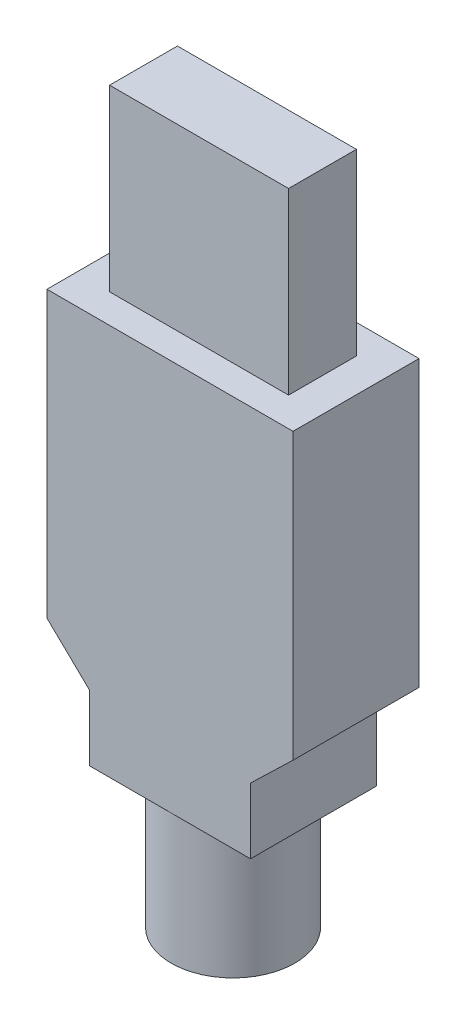
ISO-10303-21;
HEADER;
FILE_DESCRIPTION(('STEP AP214'),'2;1');
FILE_NAME('part.step','',(''),(''),'','','');
FILE_SCHEMA(('AUTOMOTIVE_DESIGN { 1 0 10303 214 1 1 1 1 }'));
ENDSEC;
DATA;
#1=APPLICATION_CONTEXT('core data for automotive mechanical design processes');
#2=APPLICATION_PROTOCOL_DEFINITION('international standard','automotive_design',2000,#1);
#3=PRODUCT_CONTEXT('',#1,'mechanical');
#4=PRODUCT('Part','Part','',(#3));
#5=PRODUCT_RELATED_PRODUCT_CATEGORY('part','',(#4));
#6=PRODUCT_DEFINITION_FORMATION('','',#4);
#7=PRODUCT_DEFINITION_CONTEXT('part definition',#1,'design');
#8=PRODUCT_DEFINITION('design','',#6,#7);
#9=PRODUCT_DEFINITION_SHAPE('','',#8);
#10=(LENGTH_UNIT() NAMED_UNIT(*) SI_UNIT(.MILLI.,.METRE.));
#11=(NAMED_UNIT(*) PLANE_ANGLE_UNIT() SI_UNIT($,.RADIAN.));
#12=(NAMED_UNIT(*) SI_UNIT($,.STERADIAN.) SOLID_ANGLE_UNIT());
#13=UNCERTAINTY_MEASURE_WITH_UNIT(LENGTH_MEASURE(1.E-05),#10,'distance_accuracy_value','');
#14=(GEOMETRIC_REPRESENTATION_CONTEXT(3) GLOBAL_UNCERTAINTY_ASSIGNED_CONTEXT((#13)) GLOBAL_UNIT_ASSIGNED_CONTEXT((#10,
#11,#12)) REPRESENTATION_CONTEXT('',''));
#15=CARTESIAN_POINT('',(0.,0.,0.));
#16=DIRECTION('',(0.,0.,1.));
#17=DIRECTION('',(1.,0.,0.));
#18=AXIS2_PLACEMENT_3D('',#15,#16,#17);
#19=CARTESIAN_POINT('',(0.,0.,-2.275));
#20=DIRECTION('',(0.,0.,-1.));
#21=DIRECTION('',(0.,-1.,0.));
#22=AXIS2_PLACEMENT_3D('',#19,#20,#21);
#23=PLANE('',#22);
#24=DIRECTION('',(1.,0.,0.));
#25=VECTOR('',#24,1.);
#26=CARTESIAN_POINT('',(6.,147.025,-2.275));
#27=LINE('',#26,#25);
#28=CARTESIAN_POINT('',(-6.,147.025,-2.275));
#29=VERTEX_POINT('',#28);
#30=CARTESIAN_POINT('',(6.,147.025,-2.275));
#31=VERTEX_POINT('',#30);
#32=EDGE_CURVE('P0_E72',#29,#31,#27,.T.);
#33=ORIENTED_EDGE('',*,*,#32,.F.);
#34=DIRECTION('',(0.,-1.,0.));
#35=VECTOR('',#34,1.);
#36=CARTESIAN_POINT('',(-6.,147.025,-2.275));
#37=LINE('',#36,#35);
#38=CARTESIAN_POINT('',(-6.,159.025,-2.275));
#39=VERTEX_POINT('',#38);
#40=EDGE_CURVE('P0_E27',#39,#29,#37,.T.);
#41=ORIENTED_EDGE('',*,*,#40,.F.);
#42=DIRECTION('',(-1.,0.,0.));
#43=VECTOR('',#42,1.);
#44=CARTESIAN_POINT('',(-6.,159.025,-2.275));
#45=LINE('',#44,#43);
#46=CARTESIAN_POINT('',(6.,159.025,-2.275));
#47=VERTEX_POINT('',#46);
#48=EDGE_CURVE('P0_E20',#47,#39,#45,.T.);
#49=ORIENTED_EDGE('',*,*,#48,.F.);
#50=DIRECTION('',(0.,1.,0.));
#51=VECTOR('',#50,1.);
#52=CARTESIAN_POINT('',(6.,159.025,-2.275));
#53=LINE('',#52,#51);
#54=EDGE_CURVE('P0_E69',#31,#47,#53,.T.);
#55=ORIENTED_EDGE('',*,*,#54,.F.);
#56=EDGE_LOOP('',(#33,#41,#49,#55));
#57=FACE_BOUND('',#56,.T.);
#58=ADVANCED_FACE('P0_F16',(#57),#23,.T.);
#59=CARTESIAN_POINT('',(0.,0.,2.275));
#60=DIRECTION('',(0.,0.,-1.));
#61=DIRECTION('',(0.,-1.,0.));
#62=AXIS2_PLACEMENT_3D('',#59,#60,#61);
#63=PLANE('',#62);
#64=DIRECTION('',(1.,0.,0.));
#65=VECTOR('',#64,1.);
#66=CARTESIAN_POINT('',(6.,147.025,2.275));
#67=LINE('',#66,#65);
#68=CARTESIAN_POINT('',(-6.,147.025,2.275));
#69=VERTEX_POINT('',#68);
#70=CARTESIAN_POINT('',(6.,147.025,2.275));
#71=VERTEX_POINT('',#70);
#72=EDGE_CURVE('P0_E90',#69,#71,#67,.T.);
#73=ORIENTED_EDGE('',*,*,#72,.T.);
#74=DIRECTION('',(0.,1.,0.));
#75=VECTOR('',#74,1.);
#76=CARTESIAN_POINT('',(6.,159.025,2.275));
#77=LINE('',#76,#75);
#78=CARTESIAN_POINT('',(6.,159.025,2.275));
#79=VERTEX_POINT('',#78);
#80=EDGE_CURVE('P0_E85',#71,#79,#77,.T.);
#81=ORIENTED_EDGE('',*,*,#80,.T.);
#82=DIRECTION('',(-1.,0.,0.));
#83=VECTOR('',#82,1.);
#84=CARTESIAN_POINT('',(-6.,159.025,2.275));
#85=LINE('',#84,#83);
#86=CARTESIAN_POINT('',(-6.,159.025,2.275));
#87=VERTEX_POINT('',#86);
#88=EDGE_CURVE('P0_E100',#79,#87,#85,.T.);
#89=ORIENTED_EDGE('',*,*,#88,.T.);
#90=DIRECTION('',(0.,-1.,0.));
#91=VECTOR('',#90,1.);
#92=CARTESIAN_POINT('',(-6.,147.025,2.275));
#93=LINE('',#92,#91);
#94=EDGE_CURVE('P0_E11',#87,#69,#93,.T.);
#95=ORIENTED_EDGE('',*,*,#94,.T.);
#96=EDGE_LOOP('',(#73,#81,#89,#95));
#97=FACE_BOUND('',#96,.T.);
#98=ADVANCED_FACE('P0_F197',(#97),#63,.F.);
#99=CARTESIAN_POINT('',(-6.,147.025,2.275));
#100=DIRECTION('',(1.,0.,0.));
#101=DIRECTION('',(0.,1.,0.));
#102=AXIS2_PLACEMENT_3D('',#99,#100,#101);
#103=PLANE('',#102);
#104=ORIENTED_EDGE('',*,*,#40,.T.);
#105=DIRECTION('',(0.,0.,-1.));
#106=VECTOR('',#105,1.);
#107=CARTESIAN_POINT('',(-6.,147.025,2.275));
#108=LINE('',#107,#106);
#109=EDGE_CURVE('P0_E79',#69,#29,#108,.T.);
#110=ORIENTED_EDGE('',*,*,#109,.F.);
#111=ORIENTED_EDGE('',*,*,#94,.F.);
#112=DIRECTION('',(0.,0.,-1.));
#113=VECTOR('',#112,1.);
#114=CARTESIAN_POINT('',(-6.,159.025,2.275));
#115=LINE('',#114,#113);
#116=EDGE_CURVE('P0_E101',#87,#39,#115,.T.);
#117=ORIENTED_EDGE('',*,*,#116,.T.);
#118=EDGE_LOOP('',(#104,#110,#111,#117));
#119=FACE_BOUND('',#118,.T.);
#120=ADVANCED_FACE('P0_F190',(#119),#103,.F.);
#121=CARTESIAN_POINT('',(-6.,159.025,2.275));
#122=DIRECTION('',(0.,-1.,0.));
#123=DIRECTION('',(0.,0.,-1.));
#124=AXIS2_PLACEMENT_3D('',#121,#122,#123);
#125=PLANE('',#124);
#126=ORIENTED_EDGE('',*,*,#48,.T.);
#127=ORIENTED_EDGE('',*,*,#116,.F.);
#128=ORIENTED_EDGE('',*,*,#88,.F.);
#129=DIRECTION('',(0.,0.,-1.));
#130=VECTOR('',#129,1.);
#131=CARTESIAN_POINT('',(6.,159.025,2.275));
#132=LINE('',#131,#130);
#133=EDGE_CURVE('P0_E78',#79,#47,#132,.T.);
#134=ORIENTED_EDGE('',*,*,#133,.T.);
#135=EDGE_LOOP('',(#126,#127,#128,#134));
#136=FACE_BOUND('',#135,.T.);
#137=ADVANCED_FACE('P0_F116',(#136),#125,.F.);
#138=CARTESIAN_POINT('',(6.,159.025,2.275));
#139=DIRECTION('',(-1.,0.,0.));
#140=DIRECTION('',(0.,0.,1.));
#141=AXIS2_PLACEMENT_3D('',#138,#139,#140);
#142=PLANE('',#141);
#143=ORIENTED_EDGE('',*,*,#54,.T.);
#144=ORIENTED_EDGE('',*,*,#133,.F.);
#145=ORIENTED_EDGE('',*,*,#80,.F.);
#146=DIRECTION('',(0.,0.,-1.));
#147=VECTOR('',#146,1.);
#148=CARTESIAN_POINT('',(6.,147.025,2.275));
#149=LINE('',#148,#147);
#150=EDGE_CURVE('P0_E82',#71,#31,#149,.T.);
#151=ORIENTED_EDGE('',*,*,#150,.T.);
#152=EDGE_LOOP('',(#143,#144,#145,#151));
#153=FACE_BOUND('',#152,.T.);
#154=ADVANCED_FACE('P0_F83',(#153),#142,.F.);
#155=CARTESIAN_POINT('',(6.,147.025,2.275));
#156=DIRECTION('',(0.,1.,0.));
#157=DIRECTION('',(1.,0.,0.));
#158=AXIS2_PLACEMENT_3D('',#155,#156,#157);
#159=PLANE('',#158);
#160=ORIENTED_EDGE('',*,*,#32,.T.);
#161=ORIENTED_EDGE('',*,*,#150,.F.);
#162=ORIENTED_EDGE('',*,*,#72,.F.);
#163=ORIENTED_EDGE('',*,*,#109,.T.);
#164=EDGE_LOOP('',(#160,#161,#162,#163));
#165=FACE_BOUND('',#164,.T.);
#166=ADVANCED_FACE('P0_F18',(#165),#159,.F.);
#167=CLOSED_SHELL('',(#58,#98,#120,#137,#154,#166));
#168=MANIFOLD_SOLID_BREP('P0_B1',#167);
#169=CARTESIAN_POINT('',(-4.25,111.975,4.225));
#170=DIRECTION('',(0.,1.,0.));
#171=DIRECTION('',(1.,0.,0.));
#172=AXIS2_PLACEMENT_3D('',#169,#170,#171);
#173=PLANE('',#172);
#174=CARTESIAN_POINT('',(0.,111.975,0.));
#175=DIRECTION('',(0.,-1.,0.));
#176=DIRECTION('',(0.,0.,-1.));
#177=AXIS2_PLACEMENT_3D('',#174,#175,#176);
#178=CIRCLE('',#177,4.15);
#179=CARTESIAN_POINT('',(0.,111.975,-4.15));
#180=VERTEX_POINT('',#179);
#181=EDGE_CURVE('P1_E11',#180,#180,#178,.T.);
#182=ORIENTED_EDGE('',*,*,#181,.T.);
#183=EDGE_LOOP('',(#182));
#184=FACE_BOUND('',#183,.T.);
#185=ADVANCED_FACE('P1_F16',(#184),#173,.F.);
#186=CARTESIAN_POINT('',(0.,120.775,0.));
#187=DIRECTION('',(0.,-1.,0.));
#188=DIRECTION('',(0.,0.,-1.));
#189=AXIS2_PLACEMENT_3D('',#186,#187,#188);
#190=CYLINDRICAL_SURFACE('',#189,4.15);
#191=CARTESIAN_POINT('',(0.,120.775,0.));
#192=DIRECTION('',(0.,-1.,0.));
#193=DIRECTION('',(0.,0.,-1.));
#194=AXIS2_PLACEMENT_3D('',#191,#192,#193);
#195=CIRCLE('',#194,4.15);
#196=CARTESIAN_POINT('',(0.,120.775,-4.15));
#197=VERTEX_POINT('',#196);
#198=EDGE_CURVE('P1_E172',#197,#197,#195,.T.);
#199=ORIENTED_EDGE('',*,*,#198,.T.);
#200=EDGE_LOOP('',(#199));
#201=FACE_BOUND('',#200,.T.);
#202=ORIENTED_EDGE('',*,*,#181,.F.);
#203=EDGE_LOOP('',(#202));
#204=FACE_BOUND('',#203,.T.);
#205=ADVANCED_FACE('P1_F406',(#201,#204),#190,.T.);
#206=CARTESIAN_POINT('',(-8.25,147.025,4.225));
#207=DIRECTION('',(0.,-1.,0.));
#208=DIRECTION('',(0.,0.,-1.));
#209=AXIS2_PLACEMENT_3D('',#206,#207,#208);
#210=PLANE('',#209);
#211=DIRECTION('',(-1.,0.,0.));
#212=VECTOR('',#211,1.);
#213=CARTESIAN_POINT('',(-8.25,147.025,-4.225));
#214=LINE('',#213,#212);
#215=CARTESIAN_POINT('',(8.25,147.025,-4.225));
#216=VERTEX_POINT('',#215);
#217=CARTESIAN_POINT('',(-8.25,147.025,-4.225));
#218=VERTEX_POINT('',#217);
#219=EDGE_CURVE('P1_E166',#216,#218,#214,.T.);
#220=ORIENTED_EDGE('',*,*,#219,.T.);
#221=DIRECTION('',(0.,0.,-1.));
#222=VECTOR('',#221,1.);
#223=CARTESIAN_POINT('',(-8.25,147.025,4.225));
#224=LINE('',#223,#222);
#225=CARTESIAN_POINT('',(-8.25,147.025,4.225));
#226=VERTEX_POINT('',#225);
#227=EDGE_CURVE('P1_E60',#226,#218,#224,.T.);
#228=ORIENTED_EDGE('',*,*,#227,.F.);
#229=DIRECTION('',(-1.,0.,0.));
#230=VECTOR('',#229,1.);
#231=CARTESIAN_POINT('',(-8.25,147.025,4.225));
#232=LINE('',#231,#230);
#233=CARTESIAN_POINT('',(8.25,147.025,4.225));
#234=VERTEX_POINT('',#233);
#235=EDGE_CURVE('P1_E142',#234,#226,#232,.T.);
#236=ORIENTED_EDGE('',*,*,#235,.F.);
#237=DIRECTION('',(0.,0.,-1.));
#238=VECTOR('',#237,1.);
#239=CARTESIAN_POINT('',(8.25,147.025,4.225));
#240=LINE('',#239,#238);
#241=EDGE_CURVE('P1_E26',#234,#216,#240,.T.);
#242=ORIENTED_EDGE('',*,*,#241,.T.);
#243=EDGE_LOOP('',(#220,#228,#236,#242));
#244=FACE_BOUND('',#243,.T.);
#245=ADVANCED_FACE('P1_F227',(#244),#210,.F.);
#246=CARTESIAN_POINT('',(8.25,147.025,4.225));
#247=DIRECTION('',(-1.,0.,0.));
#248=DIRECTION('',(0.,0.,1.));
#249=AXIS2_PLACEMENT_3D('',#246,#247,#248);
#250=PLANE('',#249);
#251=DIRECTION('',(0.,1.,0.));
#252=VECTOR('',#251,1.);
#253=CARTESIAN_POINT('',(8.25,147.025,-4.225));
#254=LINE('',#253,#252);
#255=CARTESIAN_POINT('',(8.25,127.925,-4.225));
#256=VERTEX_POINT('',#255);
#257=EDGE_CURVE('P1_E161',#256,#216,#254,.T.);
#258=ORIENTED_EDGE('',*,*,#257,.T.);
#259=ORIENTED_EDGE('',*,*,#241,.F.);
#260=DIRECTION('',(0.,1.,0.));
#261=VECTOR('',#260,1.);
#262=CARTESIAN_POINT('',(8.25,147.025,4.225));
#263=LINE('',#262,#261);
#264=CARTESIAN_POINT('',(8.25,127.925,4.225));
#265=VERTEX_POINT('',#264);
#266=EDGE_CURVE('P1_E149',#265,#234,#263,.T.);
#267=ORIENTED_EDGE('',*,*,#266,.F.);
#268=DIRECTION('',(0.,0.,-1.));
#269=VECTOR('',#268,1.);
#270=CARTESIAN_POINT('',(8.25,127.925,4.225));
#271=LINE('',#270,#269);
#272=EDGE_CURVE('P1_E184',#265,#256,#271,.T.);
#273=ORIENTED_EDGE('',*,*,#272,.T.);
#274=EDGE_LOOP('',(#258,#259,#267,#273));
#275=FACE_BOUND('',#274,.T.);
#276=ADVANCED_FACE('P1_F223',(#275),#250,.F.);
#277=CARTESIAN_POINT('',(8.25,127.925,4.225));
#278=DIRECTION('',(-0.694369173833094,0.719618961972478,0.));
#279=DIRECTION('',(0.,0.,1.));
#280=AXIS2_PLACEMENT_3D('',#277,#278,#279);
#281=PLANE('',#280);
#282=DIRECTION('',(0.719618961972478,0.694369173833094,0.));
#283=VECTOR('',#282,1.);
#284=CARTESIAN_POINT('',(8.25,127.925,-4.225));
#285=LINE('',#284,#283);
#286=CARTESIAN_POINT('',(5.4,125.175,-4.225));
#287=VERTEX_POINT('',#286);
#288=EDGE_CURVE('P1_E165',#287,#256,#285,.T.);
#289=ORIENTED_EDGE('',*,*,#288,.T.);
#290=ORIENTED_EDGE('',*,*,#272,.F.);
#291=DIRECTION('',(0.719618961972478,0.694369173833094,0.));
#292=VECTOR('',#291,1.);
#293=CARTESIAN_POINT('',(8.25,127.925,4.225));
#294=LINE('',#293,#292);
#295=CARTESIAN_POINT('',(5.4,125.175,4.225));
#296=VERTEX_POINT('',#295);
#297=EDGE_CURVE('P1_E157',#296,#265,#294,.T.);
#298=ORIENTED_EDGE('',*,*,#297,.F.);
#299=DIRECTION('',(0.,0.,-1.));
#300=VECTOR('',#299,1.);
#301=CARTESIAN_POINT('',(5.4,125.175,4.225));
#302=LINE('',#301,#300);
#303=EDGE_CURVE('P1_E153',#296,#287,#302,.T.);
#304=ORIENTED_EDGE('',*,*,#303,.T.);
#305=EDGE_LOOP('',(#289,#290,#298,#304));
#306=FACE_BOUND('',#305,.T.);
#307=ADVANCED_FACE('P1_F220',(#306),#281,.F.);
#308=CARTESIAN_POINT('',(5.4,125.175,4.225));
#309=DIRECTION('',(-1.,0.,0.));
#310=DIRECTION('',(0.,0.,1.));
#311=AXIS2_PLACEMENT_3D('',#308,#309,#310);
#312=PLANE('',#311);
#313=DIRECTION('',(0.,1.,0.));
#314=VECTOR('',#313,1.);
#315=CARTESIAN_POINT('',(5.4,125.175,-4.225));
#316=LINE('',#315,#314);
#317=CARTESIAN_POINT('',(5.4,120.775,-4.225));
#318=VERTEX_POINT('',#317);
#319=EDGE_CURVE('P1_E128',#318,#287,#316,.T.);
#320=ORIENTED_EDGE('',*,*,#319,.T.);
#321=ORIENTED_EDGE('',*,*,#303,.F.);
#322=DIRECTION('',(0.,1.,0.));
#323=VECTOR('',#322,1.);
#324=CARTESIAN_POINT('',(5.4,125.175,4.225));
#325=LINE('',#324,#323);
#326=CARTESIAN_POINT('',(5.4,120.775,4.225));
#327=VERTEX_POINT('',#326);
#328=EDGE_CURVE('P1_E167',#327,#296,#325,.T.);
#329=ORIENTED_EDGE('',*,*,#328,.F.);
#330=DIRECTION('',(0.,0.,-1.));
#331=VECTOR('',#330,1.);
#332=CARTESIAN_POINT('',(5.4,120.775,4.225));
#333=LINE('',#332,#331);
#334=EDGE_CURVE('P1_E175',#327,#318,#333,.T.);
#335=ORIENTED_EDGE('',*,*,#334,.T.);
#336=EDGE_LOOP('',(#320,#321,#329,#335));
#337=FACE_BOUND('',#336,.T.);
#338=ADVANCED_FACE('P1_F215',(#337),#312,.F.);
#339=CARTESIAN_POINT('',(4.25,120.775,4.225));
#340=DIRECTION('',(0.,1.,0.));
#341=DIRECTION('',(1.,0.,0.));
#342=AXIS2_PLACEMENT_3D('',#339,#340,#341);
#343=PLANE('',#342);
#344=ORIENTED_EDGE('',*,*,#198,.F.);
#345=EDGE_LOOP('',(#344));
#346=FACE_BOUND('',#345,.T.);
#347=DIRECTION('',(1.,0.,0.));
#348=VECTOR('',#347,1.);
#349=CARTESIAN_POINT('',(4.25,120.775,-4.225));
#350=LINE('',#349,#348);
#351=CARTESIAN_POINT('',(-5.4,120.775,-4.225));
#352=VERTEX_POINT('',#351);
#353=EDGE_CURVE('P1_E159',#352,#318,#350,.T.);
#354=ORIENTED_EDGE('',*,*,#353,.T.);
#355=ORIENTED_EDGE('',*,*,#334,.F.);
#356=DIRECTION('',(1.,0.,0.));
#357=VECTOR('',#356,1.);
#358=CARTESIAN_POINT('',(-5.4,120.775,4.225));
#359=LINE('',#358,#357);
#360=CARTESIAN_POINT('',(-5.4,120.775,4.225));
#361=VERTEX_POINT('',#360);
#362=EDGE_CURVE('P1_E171',#361,#327,#359,.T.);
#363=ORIENTED_EDGE('',*,*,#362,.F.);
#364=DIRECTION('',(0.,0.,-1.));
#365=VECTOR('',#364,1.);
#366=CARTESIAN_POINT('',(-5.4,120.775,4.225));
#367=LINE('',#366,#365);
#368=EDGE_CURVE('P1_E187',#361,#352,#367,.T.);
#369=ORIENTED_EDGE('',*,*,#368,.T.);
#370=EDGE_LOOP('',(#354,#355,#363,#369));
#371=FACE_BOUND('',#370,.T.);
#372=ADVANCED_FACE('P1_F210',(#346,#371),#343,.F.);
#373=CARTESIAN_POINT('',(-5.4,120.775,4.225));
#374=DIRECTION('',(1.,0.,0.));
#375=DIRECTION('',(0.,1.,0.));
#376=AXIS2_PLACEMENT_3D('',#373,#374,#375);
#377=PLANE('',#376);
#378=DIRECTION('',(0.,-1.,0.));
#379=VECTOR('',#378,1.);
#380=CARTESIAN_POINT('',(-5.4,120.775,-4.225));
#381=LINE('',#380,#379);
#382=CARTESIAN_POINT('',(-5.4,125.175,-4.225));
#383=VERTEX_POINT('',#382);
#384=EDGE_CURVE('P1_E181',#383,#352,#381,.T.);
#385=ORIENTED_EDGE('',*,*,#384,.T.);
#386=ORIENTED_EDGE('',*,*,#368,.F.);
#387=DIRECTION('',(0.,-1.,0.));
#388=VECTOR('',#387,1.);
#389=CARTESIAN_POINT('',(-5.4,120.775,4.225));
#390=LINE('',#389,#388);
#391=CARTESIAN_POINT('',(-5.4,125.175,4.225));
#392=VERTEX_POINT('',#391);
#393=EDGE_CURVE('P1_E136',#392,#361,#390,.T.);
#394=ORIENTED_EDGE('',*,*,#393,.F.);
#395=DIRECTION('',(0.,0.,-1.));
#396=VECTOR('',#395,1.);
#397=CARTESIAN_POINT('',(-5.4,125.175,4.225));
#398=LINE('',#397,#396);
#399=EDGE_CURVE('P1_E115',#392,#383,#398,.T.);
#400=ORIENTED_EDGE('',*,*,#399,.T.);
#401=EDGE_LOOP('',(#385,#386,#394,#400));
#402=FACE_BOUND('',#401,.T.);
#403=ADVANCED_FACE('P1_F363',(#402),#377,.F.);
#404=CARTESIAN_POINT('',(-5.4,125.175,4.225));
#405=DIRECTION('',(0.694369173833094,0.719618961972478,0.));
#406=DIRECTION('',(0.,0.,-1.));
#407=AXIS2_PLACEMENT_3D('',#404,#405,#406);
#408=PLANE('',#407);
#409=DIRECTION('',(0.719618961972478,-0.694369173833094,0.));
#410=VECTOR('',#409,1.);
#411=CARTESIAN_POINT('',(-5.4,125.175,-4.225));
#412=LINE('',#411,#410);
#413=CARTESIAN_POINT('',(-8.25,127.925,-4.225));
#414=VERTEX_POINT('',#413);
#415=EDGE_CURVE('P1_E199',#414,#383,#412,.T.);
#416=ORIENTED_EDGE('',*,*,#415,.T.);
#417=ORIENTED_EDGE('',*,*,#399,.F.);
#418=DIRECTION('',(0.719618961972478,-0.694369173833094,0.));
#419=VECTOR('',#418,1.);
#420=CARTESIAN_POINT('',(-5.4,125.175,4.225));
#421=LINE('',#420,#419);
#422=CARTESIAN_POINT('',(-8.25,127.925,4.225));
#423=VERTEX_POINT('',#422);
#424=EDGE_CURVE('P1_E131',#423,#392,#421,.T.);
#425=ORIENTED_EDGE('',*,*,#424,.F.);
#426=DIRECTION('',(0.,0.,-1.));
#427=VECTOR('',#426,1.);
#428=CARTESIAN_POINT('',(-8.25,127.925,4.225));
#429=LINE('',#428,#427);
#430=EDGE_CURVE('P1_E78',#423,#414,#429,.T.);
#431=ORIENTED_EDGE('',*,*,#430,.T.);
#432=EDGE_LOOP('',(#416,#417,#425,#431));
#433=FACE_BOUND('',#432,.T.);
#434=ADVANCED_FACE('P1_F132',(#433),#408,.F.);
#435=CARTESIAN_POINT('',(-8.25,127.925,4.225));
#436=DIRECTION('',(1.,0.,0.));
#437=DIRECTION('',(0.,1.,0.));
#438=AXIS2_PLACEMENT_3D('',#435,#436,#437);
#439=PLANE('',#438);
#440=DIRECTION('',(0.,-1.,0.));
#441=VECTOR('',#440,1.);
#442=CARTESIAN_POINT('',(-8.25,127.925,-4.225));
#443=LINE('',#442,#441);
#444=EDGE_CURVE('P1_E19',#218,#414,#443,.T.);
#445=ORIENTED_EDGE('',*,*,#444,.T.);
#446=ORIENTED_EDGE('',*,*,#430,.F.);
#447=DIRECTION('',(0.,-1.,0.));
#448=VECTOR('',#447,1.);
#449=CARTESIAN_POINT('',(-8.25,127.925,4.225));
#450=LINE('',#449,#448);
#451=EDGE_CURVE('P1_E123',#226,#423,#450,.T.);
#452=ORIENTED_EDGE('',*,*,#451,.F.);
#453=ORIENTED_EDGE('',*,*,#227,.T.);
#454=EDGE_LOOP('',(#445,#446,#452,#453));
#455=FACE_BOUND('',#454,.T.);
#456=ADVANCED_FACE('P1_F121',(#455),#439,.F.);
#457=CARTESIAN_POINT('',(0.,0.,-4.225));
#458=DIRECTION('',(0.,0.,-1.));
#459=DIRECTION('',(0.,-1.,0.));
#460=AXIS2_PLACEMENT_3D('',#457,#458,#459);
#461=PLANE('',#460);
#462=ORIENTED_EDGE('',*,*,#353,.F.);
#463=ORIENTED_EDGE('',*,*,#384,.F.);
#464=ORIENTED_EDGE('',*,*,#415,.F.);
#465=ORIENTED_EDGE('',*,*,#444,.F.);
#466=ORIENTED_EDGE('',*,*,#219,.F.);
#467=ORIENTED_EDGE('',*,*,#257,.F.);
#468=ORIENTED_EDGE('',*,*,#288,.F.);
#469=ORIENTED_EDGE('',*,*,#319,.F.);
#470=EDGE_LOOP('',(#462,#463,#464,#465,#466,#467,#468,#469));
#471=FACE_BOUND('',#470,.T.);
#472=ADVANCED_FACE('P1_F229',(#471),#461,.T.);
#473=CARTESIAN_POINT('',(0.,0.,4.225));
#474=DIRECTION('',(0.,0.,-1.));
#475=DIRECTION('',(0.,-1.,0.));
#476=AXIS2_PLACEMENT_3D('',#473,#474,#475);
#477=PLANE('',#476);
#478=ORIENTED_EDGE('',*,*,#362,.T.);
#479=ORIENTED_EDGE('',*,*,#328,.T.);
#480=ORIENTED_EDGE('',*,*,#297,.T.);
#481=ORIENTED_EDGE('',*,*,#266,.T.);
#482=ORIENTED_EDGE('',*,*,#235,.T.);
#483=ORIENTED_EDGE('',*,*,#451,.T.);
#484=ORIENTED_EDGE('',*,*,#424,.T.);
#485=ORIENTED_EDGE('',*,*,#393,.T.);
#486=EDGE_LOOP('',(#478,#479,#480,#481,#482,#483,#484,#485));
#487=FACE_BOUND('',#486,.T.);
#488=ADVANCED_FACE('P1_F139',(#487),#477,.F.);
#489=CLOSED_SHELL('',(#185,#205,#245,#276,#307,#338,#372,#403,#434,#456,#472,#488));
#490=MANIFOLD_SOLID_BREP('P1_B1',#489);
#491=ADVANCED_BREP_SHAPE_REPRESENTATION('',(#18,#168,#490),#14);
#492=SHAPE_DEFINITION_REPRESENTATION(#9,#491);
ENDSEC;
END-ISO-10303-21;
